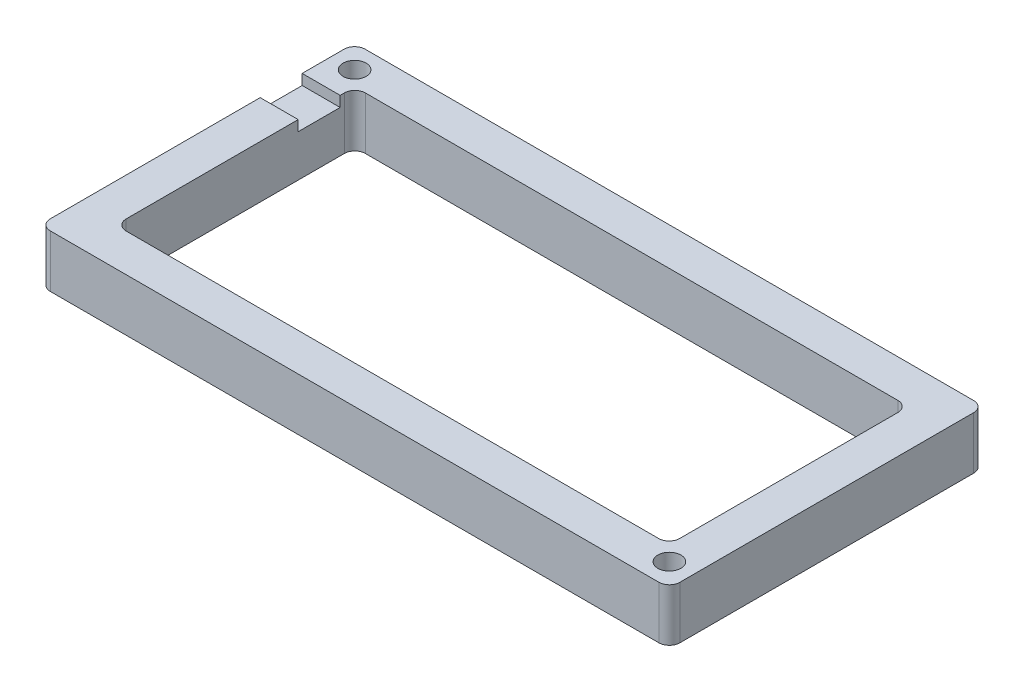
ISO-10303-21;
HEADER;
FILE_DESCRIPTION(('STEP AP214'),'2;1');
FILE_NAME('part.step','',(''),(''),'','','');
FILE_SCHEMA(('AUTOMOTIVE_DESIGN { 1 0 10303 214 1 1 1 1 }'));
ENDSEC;
DATA;
#1=APPLICATION_CONTEXT('core data for automotive mechanical design processes');
#2=APPLICATION_PROTOCOL_DEFINITION('international standard','automotive_design',2000,#1);
#3=PRODUCT_CONTEXT('',#1,'mechanical');
#4=PRODUCT('Part','Part','',(#3));
#5=PRODUCT_RELATED_PRODUCT_CATEGORY('part','',(#4));
#6=PRODUCT_DEFINITION_FORMATION('','',#4);
#7=PRODUCT_DEFINITION_CONTEXT('part definition',#1,'design');
#8=PRODUCT_DEFINITION('design','',#6,#7);
#9=PRODUCT_DEFINITION_SHAPE('','',#8);
#10=(LENGTH_UNIT() NAMED_UNIT(*) SI_UNIT(.MILLI.,.METRE.));
#11=(NAMED_UNIT(*) PLANE_ANGLE_UNIT() SI_UNIT($,.RADIAN.));
#12=(NAMED_UNIT(*) SI_UNIT($,.STERADIAN.) SOLID_ANGLE_UNIT());
#13=UNCERTAINTY_MEASURE_WITH_UNIT(LENGTH_MEASURE(1.E-05),#10,'distance_accuracy_value','');
#14=(GEOMETRIC_REPRESENTATION_CONTEXT(3) GLOBAL_UNCERTAINTY_ASSIGNED_CONTEXT((#13)) GLOBAL_UNIT_ASSIGNED_CONTEXT((#10,
#11,#12)) REPRESENTATION_CONTEXT('',''));
#15=CARTESIAN_POINT('',(0.,0.,0.));
#16=DIRECTION('',(0.,0.,1.));
#17=DIRECTION('',(1.,0.,0.));
#18=AXIS2_PLACEMENT_3D('',#15,#16,#17);
#19=CARTESIAN_POINT('',(0.,12.7,0.));
#20=DIRECTION('',(0.,1.,0.));
#21=DIRECTION('',(0.,0.,1.));
#22=AXIS2_PLACEMENT_3D('',#19,#20,#21);
#23=PLANE('',#22);
#24=CARTESIAN_POINT('',(70.612,12.7,32.512));
#25=DIRECTION('',(0.,1.,0.));
#26=DIRECTION('',(0.,0.,1.));
#27=AXIS2_PLACEMENT_3D('',#24,#25,#26);
#28=CIRCLE('',#27,2.79400000000001);
#29=CARTESIAN_POINT('',(70.612,12.7,35.306));
#30=VERTEX_POINT('',#29);
#31=EDGE_CURVE('E526',#30,#30,#28,.T.);
#32=ORIENTED_EDGE('',*,*,#31,.F.);
#33=EDGE_LOOP('',(#32));
#34=FACE_BOUND('',#33,.T.);
#35=CARTESIAN_POINT('',(-70.612,12.7,-32.512));
#36=DIRECTION('',(0.,1.,0.));
#37=DIRECTION('',(0.,0.,1.));
#38=AXIS2_PLACEMENT_3D('',#35,#36,#37);
#39=CIRCLE('',#38,2.79400000000001);
#40=CARTESIAN_POINT('',(-70.612,12.7,-29.718));
#41=VERTEX_POINT('',#40);
#42=EDGE_CURVE('E198',#41,#41,#39,.T.);
#43=ORIENTED_EDGE('',*,*,#42,.F.);
#44=EDGE_LOOP('',(#43));
#45=FACE_BOUND('',#44,.T.);
#46=DIRECTION('',(-1.,0.,0.));
#47=VECTOR('',#46,1.);
#48=CARTESIAN_POINT('',(-63.5,12.7,-25.4));
#49=LINE('',#48,#47);
#50=CARTESIAN_POINT('',(-66.9974831845845,12.7,-25.4));
#51=VERTEX_POINT('',#50);
#52=CARTESIAN_POINT('',(-76.2,12.7,-25.4));
#53=VERTEX_POINT('',#52);
#54=EDGE_CURVE('E193',#51,#53,#49,.T.);
#55=ORIENTED_EDGE('',*,*,#54,.F.);
#56=DIRECTION('',(0.,0.,1.));
#57=VECTOR('',#56,1.);
#58=CARTESIAN_POINT('',(-66.9974831845845,12.7,-28.956));
#59=LINE('',#58,#57);
#60=CARTESIAN_POINT('',(-66.9974831845845,12.7,-26.416));
#61=VERTEX_POINT('',#60);
#62=EDGE_CURVE('E226',#61,#51,#59,.T.);
#63=ORIENTED_EDGE('',*,*,#62,.F.);
#64=CARTESIAN_POINT('',(-64.4574831845845,12.7,-26.416));
#65=DIRECTION('',(0.,1.,0.));
#66=DIRECTION('',(0.,0.,1.));
#67=AXIS2_PLACEMENT_3D('',#64,#65,#66);
#68=CIRCLE('',#67,2.54);
#69=CARTESIAN_POINT('',(-64.4574831845845,12.7,-28.956));
#70=VERTEX_POINT('',#69);
#71=EDGE_CURVE('E371',#61,#70,#68,.F.);
#72=ORIENTED_EDGE('',*,*,#71,.T.);
#73=DIRECTION('',(-1.,0.,0.));
#74=VECTOR('',#73,1.);
#75=CARTESIAN_POINT('',(-66.9974831845845,12.7,-28.956));
#76=LINE('',#75,#74);
#77=CARTESIAN_POINT('',(64.4574831845845,12.7,-28.956));
#78=VERTEX_POINT('',#77);
#79=EDGE_CURVE('E220',#78,#70,#76,.T.);
#80=ORIENTED_EDGE('',*,*,#79,.F.);
#81=CARTESIAN_POINT('',(64.4574831845845,12.7,-26.416));
#82=DIRECTION('',(0.,1.,0.));
#83=DIRECTION('',(0.,0.,1.));
#84=AXIS2_PLACEMENT_3D('',#81,#82,#83);
#85=CIRCLE('',#84,2.54);
#86=CARTESIAN_POINT('',(66.9974831845845,12.7,-26.416));
#87=VERTEX_POINT('',#86);
#88=EDGE_CURVE('E63',#78,#87,#85,.F.);
#89=ORIENTED_EDGE('',*,*,#88,.T.);
#90=DIRECTION('',(0.,0.,-1.));
#91=VECTOR('',#90,1.);
#92=CARTESIAN_POINT('',(66.9974831845845,12.7,-28.956));
#93=LINE('',#92,#91);
#94=CARTESIAN_POINT('',(66.9974831845845,12.7,26.416));
#95=VERTEX_POINT('',#94);
#96=EDGE_CURVE('E217',#95,#87,#93,.T.);
#97=ORIENTED_EDGE('',*,*,#96,.F.);
#98=CARTESIAN_POINT('',(64.4574831845845,12.7,26.416));
#99=DIRECTION('',(0.,1.,0.));
#100=DIRECTION('',(0.,0.,1.));
#101=AXIS2_PLACEMENT_3D('',#98,#99,#100);
#102=CIRCLE('',#101,2.54);
#103=CARTESIAN_POINT('',(64.4574831845845,12.7,28.956));
#104=VERTEX_POINT('',#103);
#105=EDGE_CURVE('E382',#95,#104,#102,.F.);
#106=ORIENTED_EDGE('',*,*,#105,.T.);
#107=DIRECTION('',(1.,0.,0.));
#108=VECTOR('',#107,1.);
#109=CARTESIAN_POINT('',(-66.9974831845845,12.7,28.956));
#110=LINE('',#109,#108);
#111=CARTESIAN_POINT('',(-64.4574831845845,12.7,28.956));
#112=VERTEX_POINT('',#111);
#113=EDGE_CURVE('E230',#112,#104,#110,.T.);
#114=ORIENTED_EDGE('',*,*,#113,.F.);
#115=CARTESIAN_POINT('',(-64.4574831845845,12.7,26.416));
#116=DIRECTION('',(0.,1.,0.));
#117=DIRECTION('',(0.,0.,1.));
#118=AXIS2_PLACEMENT_3D('',#115,#116,#117);
#119=CIRCLE('',#118,2.54);
#120=CARTESIAN_POINT('',(-66.9974831845845,12.7,26.416));
#121=VERTEX_POINT('',#120);
#122=EDGE_CURVE('E364',#112,#121,#119,.F.);
#123=ORIENTED_EDGE('',*,*,#122,.T.);
#124=CARTESIAN_POINT('',(-66.9974831845845,12.7,-15.24));
#125=VERTEX_POINT('',#124);
#126=EDGE_CURVE('E225',#125,#121,#59,.T.);
#127=ORIENTED_EDGE('',*,*,#126,.F.);
#128=DIRECTION('',(-1.,0.,0.));
#129=VECTOR('',#128,1.);
#130=CARTESIAN_POINT('',(-63.5,12.7,-15.24));
#131=LINE('',#130,#129);
#132=CARTESIAN_POINT('',(-76.2,12.7,-15.24));
#133=VERTEX_POINT('',#132);
#134=EDGE_CURVE('E211',#125,#133,#131,.T.);
#135=ORIENTED_EDGE('',*,*,#134,.T.);
#136=DIRECTION('',(0.,0.,1.));
#137=VECTOR('',#136,1.);
#138=CARTESIAN_POINT('',(-76.2,12.7,-38.1));
#139=LINE('',#138,#137);
#140=CARTESIAN_POINT('',(-76.2,12.7,35.56));
#141=VERTEX_POINT('',#140);
#142=EDGE_CURVE('E258',#133,#141,#139,.T.);
#143=ORIENTED_EDGE('',*,*,#142,.T.);
#144=CARTESIAN_POINT('',(-73.66,12.7,35.56));
#145=DIRECTION('',(0.,1.,0.));
#146=DIRECTION('',(0.,0.,1.));
#147=AXIS2_PLACEMENT_3D('',#144,#145,#146);
#148=CIRCLE('',#147,2.54);
#149=CARTESIAN_POINT('',(-73.66,12.7,38.1));
#150=VERTEX_POINT('',#149);
#151=EDGE_CURVE('E306',#141,#150,#148,.T.);
#152=ORIENTED_EDGE('',*,*,#151,.T.);
#153=DIRECTION('',(1.,0.,0.));
#154=VECTOR('',#153,1.);
#155=CARTESIAN_POINT('',(-76.2,12.7,38.1));
#156=LINE('',#155,#154);
#157=CARTESIAN_POINT('',(73.66,12.7,38.1));
#158=VERTEX_POINT('',#157);
#159=EDGE_CURVE('E262',#150,#158,#156,.T.);
#160=ORIENTED_EDGE('',*,*,#159,.T.);
#161=CARTESIAN_POINT('',(73.66,12.7,35.56));
#162=DIRECTION('',(0.,1.,0.));
#163=DIRECTION('',(0.,0.,1.));
#164=AXIS2_PLACEMENT_3D('',#161,#162,#163);
#165=CIRCLE('',#164,2.54);
#166=CARTESIAN_POINT('',(76.2,12.7,35.56));
#167=VERTEX_POINT('',#166);
#168=EDGE_CURVE('E315',#158,#167,#165,.T.);
#169=ORIENTED_EDGE('',*,*,#168,.T.);
#170=DIRECTION('',(0.,0.,-1.));
#171=VECTOR('',#170,1.);
#172=CARTESIAN_POINT('',(76.2,12.7,-38.1));
#173=LINE('',#172,#171);
#174=CARTESIAN_POINT('',(76.2,12.7,-35.56));
#175=VERTEX_POINT('',#174);
#176=EDGE_CURVE('E249',#167,#175,#173,.T.);
#177=ORIENTED_EDGE('',*,*,#176,.T.);
#178=CARTESIAN_POINT('',(73.66,12.7,-35.56));
#179=DIRECTION('',(0.,1.,0.));
#180=DIRECTION('',(0.,0.,1.));
#181=AXIS2_PLACEMENT_3D('',#178,#179,#180);
#182=CIRCLE('',#181,2.54);
#183=CARTESIAN_POINT('',(73.66,12.7,-38.1));
#184=VERTEX_POINT('',#183);
#185=EDGE_CURVE('E312',#175,#184,#182,.T.);
#186=ORIENTED_EDGE('',*,*,#185,.T.);
#187=DIRECTION('',(-1.,0.,0.));
#188=VECTOR('',#187,1.);
#189=CARTESIAN_POINT('',(-76.2,12.7,-38.1));
#190=LINE('',#189,#188);
#191=CARTESIAN_POINT('',(-73.66,12.7,-38.1));
#192=VERTEX_POINT('',#191);
#193=EDGE_CURVE('E253',#184,#192,#190,.T.);
#194=ORIENTED_EDGE('',*,*,#193,.T.);
#195=CARTESIAN_POINT('',(-73.66,12.7,-35.56));
#196=DIRECTION('',(0.,1.,0.));
#197=DIRECTION('',(0.,0.,1.));
#198=AXIS2_PLACEMENT_3D('',#195,#196,#197);
#199=CIRCLE('',#198,2.54);
#200=CARTESIAN_POINT('',(-76.2,12.7,-35.56));
#201=VERTEX_POINT('',#200);
#202=EDGE_CURVE('E309',#192,#201,#199,.T.);
#203=ORIENTED_EDGE('',*,*,#202,.T.);
#204=EDGE_CURVE('E259',#201,#53,#139,.T.);
#205=ORIENTED_EDGE('',*,*,#204,.T.);
#206=EDGE_LOOP('',(#55,#63,#72,#80,#89,#97,#106,#114,#123,#127,#135,#143,#152,#160,#169,#177,
#186,#194,#203,#205));
#207=FACE_BOUND('',#206,.T.);
#208=ADVANCED_FACE('F39',(#34,#45,#207),#23,.T.);
#209=CARTESIAN_POINT('',(0.,0.,0.));
#210=DIRECTION('',(0.,1.,0.));
#211=DIRECTION('',(0.,0.,1.));
#212=AXIS2_PLACEMENT_3D('',#209,#210,#211);
#213=PLANE('',#212);
#214=CARTESIAN_POINT('',(70.612,0.,32.512));
#215=DIRECTION('',(0.,1.,0.));
#216=DIRECTION('',(0.,0.,1.));
#217=AXIS2_PLACEMENT_3D('',#214,#215,#216);
#218=CIRCLE('',#217,2.79400000000001);
#219=CARTESIAN_POINT('',(70.612,0.,35.306));
#220=VERTEX_POINT('',#219);
#221=EDGE_CURVE('E529',#220,#220,#218,.T.);
#222=ORIENTED_EDGE('',*,*,#221,.T.);
#223=EDGE_LOOP('',(#222));
#224=FACE_BOUND('',#223,.T.);
#225=CARTESIAN_POINT('',(-70.612,0.,-32.512));
#226=DIRECTION('',(0.,1.,0.));
#227=DIRECTION('',(0.,0.,1.));
#228=AXIS2_PLACEMENT_3D('',#225,#226,#227);
#229=CIRCLE('',#228,2.79400000000001);
#230=CARTESIAN_POINT('',(-70.612,0.,-29.718));
#231=VERTEX_POINT('',#230);
#232=EDGE_CURVE('E533',#231,#231,#229,.T.);
#233=ORIENTED_EDGE('',*,*,#232,.T.);
#234=EDGE_LOOP('',(#233));
#235=FACE_BOUND('',#234,.T.);
#236=DIRECTION('',(0.,0.,-1.));
#237=VECTOR('',#236,1.);
#238=CARTESIAN_POINT('',(76.2,0.,-38.1));
#239=LINE('',#238,#237);
#240=CARTESIAN_POINT('',(76.2,0.,35.56));
#241=VERTEX_POINT('',#240);
#242=CARTESIAN_POINT('',(76.2,0.,-35.56));
#243=VERTEX_POINT('',#242);
#244=EDGE_CURVE('E234',#241,#243,#239,.T.);
#245=ORIENTED_EDGE('',*,*,#244,.F.);
#246=CARTESIAN_POINT('',(73.66,0.,35.56));
#247=DIRECTION('',(0.,1.,0.));
#248=DIRECTION('',(0.,0.,1.));
#249=AXIS2_PLACEMENT_3D('',#246,#247,#248);
#250=CIRCLE('',#249,2.54);
#251=CARTESIAN_POINT('',(73.66,0.,38.1));
#252=VERTEX_POINT('',#251);
#253=EDGE_CURVE('E296',#241,#252,#250,.F.);
#254=ORIENTED_EDGE('',*,*,#253,.T.);
#255=DIRECTION('',(1.,0.,0.));
#256=VECTOR('',#255,1.);
#257=CARTESIAN_POINT('',(-76.2,0.,38.1));
#258=LINE('',#257,#256);
#259=CARTESIAN_POINT('',(-73.66,0.,38.1));
#260=VERTEX_POINT('',#259);
#261=EDGE_CURVE('E254',#260,#252,#258,.T.);
#262=ORIENTED_EDGE('',*,*,#261,.F.);
#263=CARTESIAN_POINT('',(-73.66,0.,35.56));
#264=DIRECTION('',(0.,1.,0.));
#265=DIRECTION('',(0.,0.,1.));
#266=AXIS2_PLACEMENT_3D('',#263,#264,#265);
#267=CIRCLE('',#266,2.54);
#268=CARTESIAN_POINT('',(-76.2,0.,35.56));
#269=VERTEX_POINT('',#268);
#270=EDGE_CURVE('E287',#260,#269,#267,.F.);
#271=ORIENTED_EDGE('',*,*,#270,.T.);
#272=DIRECTION('',(0.,0.,1.));
#273=VECTOR('',#272,1.);
#274=CARTESIAN_POINT('',(-76.2,0.,-38.1));
#275=LINE('',#274,#273);
#276=CARTESIAN_POINT('',(-76.2,0.,-35.56));
#277=VERTEX_POINT('',#276);
#278=EDGE_CURVE('E274',#277,#269,#275,.T.);
#279=ORIENTED_EDGE('',*,*,#278,.F.);
#280=CARTESIAN_POINT('',(-73.66,0.,-35.56));
#281=DIRECTION('',(0.,1.,0.));
#282=DIRECTION('',(0.,0.,1.));
#283=AXIS2_PLACEMENT_3D('',#280,#281,#282);
#284=CIRCLE('',#283,2.54);
#285=CARTESIAN_POINT('',(-73.66,0.,-38.1));
#286=VERTEX_POINT('',#285);
#287=EDGE_CURVE('E290',#277,#286,#284,.F.);
#288=ORIENTED_EDGE('',*,*,#287,.T.);
#289=DIRECTION('',(-1.,0.,0.));
#290=VECTOR('',#289,1.);
#291=CARTESIAN_POINT('',(-76.2,0.,-38.1));
#292=LINE('',#291,#290);
#293=CARTESIAN_POINT('',(73.66,0.,-38.1));
#294=VERTEX_POINT('',#293);
#295=EDGE_CURVE('E270',#294,#286,#292,.T.);
#296=ORIENTED_EDGE('',*,*,#295,.F.);
#297=CARTESIAN_POINT('',(73.66,0.,-35.56));
#298=DIRECTION('',(0.,1.,0.));
#299=DIRECTION('',(0.,0.,1.));
#300=AXIS2_PLACEMENT_3D('',#297,#298,#299);
#301=CIRCLE('',#300,2.54);
#302=EDGE_CURVE('E293',#294,#243,#301,.F.);
#303=ORIENTED_EDGE('',*,*,#302,.T.);
#304=EDGE_LOOP('',(#245,#254,#262,#271,#279,#288,#296,#303));
#305=FACE_BOUND('',#304,.T.);
#306=DIRECTION('',(1.,0.,0.));
#307=VECTOR('',#306,1.);
#308=CARTESIAN_POINT('',(-66.9974831845845,0.,28.956));
#309=LINE('',#308,#307);
#310=CARTESIAN_POINT('',(-64.4574831845845,0.,28.956));
#311=VERTEX_POINT('',#310);
#312=CARTESIAN_POINT('',(64.4574831845845,0.,28.956));
#313=VERTEX_POINT('',#312);
#314=EDGE_CURVE('E221',#311,#313,#309,.T.);
#315=ORIENTED_EDGE('',*,*,#314,.T.);
#316=CARTESIAN_POINT('',(64.4574831845845,0.,26.416));
#317=DIRECTION('',(0.,1.,0.));
#318=DIRECTION('',(0.,0.,1.));
#319=AXIS2_PLACEMENT_3D('',#316,#317,#318);
#320=CIRCLE('',#319,2.54);
#321=CARTESIAN_POINT('',(66.9974831845845,0.,26.416));
#322=VERTEX_POINT('',#321);
#323=EDGE_CURVE('E379',#313,#322,#320,.T.);
#324=ORIENTED_EDGE('',*,*,#323,.T.);
#325=DIRECTION('',(0.,0.,-1.));
#326=VECTOR('',#325,1.);
#327=CARTESIAN_POINT('',(66.9974831845845,0.,-28.956));
#328=LINE('',#327,#326);
#329=CARTESIAN_POINT('',(66.9974831845845,0.,-26.416));
#330=VERTEX_POINT('',#329);
#331=EDGE_CURVE('E210',#322,#330,#328,.T.);
#332=ORIENTED_EDGE('',*,*,#331,.T.);
#333=CARTESIAN_POINT('',(64.4574831845845,0.,-26.416));
#334=DIRECTION('',(0.,1.,0.));
#335=DIRECTION('',(0.,0.,1.));
#336=AXIS2_PLACEMENT_3D('',#333,#334,#335);
#337=CIRCLE('',#336,2.54);
#338=CARTESIAN_POINT('',(64.4574831845845,0.,-28.956));
#339=VERTEX_POINT('',#338);
#340=EDGE_CURVE('E374',#330,#339,#337,.T.);
#341=ORIENTED_EDGE('',*,*,#340,.T.);
#342=DIRECTION('',(-1.,0.,0.));
#343=VECTOR('',#342,1.);
#344=CARTESIAN_POINT('',(-66.9974831845845,0.,-28.956));
#345=LINE('',#344,#343);
#346=CARTESIAN_POINT('',(-64.4574831845845,0.,-28.956));
#347=VERTEX_POINT('',#346);
#348=EDGE_CURVE('E238',#339,#347,#345,.T.);
#349=ORIENTED_EDGE('',*,*,#348,.T.);
#350=CARTESIAN_POINT('',(-64.4574831845845,0.,-26.416));
#351=DIRECTION('',(0.,1.,0.));
#352=DIRECTION('',(0.,0.,1.));
#353=AXIS2_PLACEMENT_3D('',#350,#351,#352);
#354=CIRCLE('',#353,2.54);
#355=CARTESIAN_POINT('',(-66.9974831845845,0.,-26.416));
#356=VERTEX_POINT('',#355);
#357=EDGE_CURVE('E368',#347,#356,#354,.T.);
#358=ORIENTED_EDGE('',*,*,#357,.T.);
#359=DIRECTION('',(0.,0.,1.));
#360=VECTOR('',#359,1.);
#361=CARTESIAN_POINT('',(-66.9974831845845,0.,-28.956));
#362=LINE('',#361,#360);
#363=CARTESIAN_POINT('',(-66.9974831845845,0.,26.416));
#364=VERTEX_POINT('',#363);
#365=EDGE_CURVE('E242',#356,#364,#362,.T.);
#366=ORIENTED_EDGE('',*,*,#365,.T.);
#367=CARTESIAN_POINT('',(-64.4574831845845,0.,26.416));
#368=DIRECTION('',(0.,1.,0.));
#369=DIRECTION('',(0.,0.,1.));
#370=AXIS2_PLACEMENT_3D('',#367,#368,#369);
#371=CIRCLE('',#370,2.54);
#372=EDGE_CURVE('E361',#364,#311,#371,.T.);
#373=ORIENTED_EDGE('',*,*,#372,.T.);
#374=EDGE_LOOP('',(#315,#324,#332,#341,#349,#358,#366,#373));
#375=FACE_BOUND('',#374,.T.);
#376=ADVANCED_FACE('F404',(#224,#235,#305,#375),#213,.F.);
#377=CARTESIAN_POINT('',(76.2,12.7,-38.1));
#378=DIRECTION('',(-1.,0.,0.));
#379=DIRECTION('',(0.,0.,1.));
#380=AXIS2_PLACEMENT_3D('',#377,#378,#379);
#381=PLANE('',#380);
#382=ORIENTED_EDGE('',*,*,#176,.F.);
#383=DIRECTION('',(0.,-1.,0.));
#384=VECTOR('',#383,1.);
#385=CARTESIAN_POINT('',(76.2,12.7,35.56));
#386=LINE('',#385,#384);
#387=EDGE_CURVE('E283',#167,#241,#386,.T.);
#388=ORIENTED_EDGE('',*,*,#387,.T.);
#389=ORIENTED_EDGE('',*,*,#244,.T.);
#390=DIRECTION('',(0.,-1.,0.));
#391=VECTOR('',#390,1.);
#392=CARTESIAN_POINT('',(76.2,12.7,-35.56));
#393=LINE('',#392,#391);
#394=EDGE_CURVE('E266',#243,#175,#393,.F.);
#395=ORIENTED_EDGE('',*,*,#394,.T.);
#396=EDGE_LOOP('',(#382,#388,#389,#395));
#397=FACE_BOUND('',#396,.T.);
#398=ADVANCED_FACE('F416',(#397),#381,.F.);
#399=CARTESIAN_POINT('',(-76.2,12.7,-38.1));
#400=DIRECTION('',(0.,0.,1.));
#401=DIRECTION('',(1.,0.,0.));
#402=AXIS2_PLACEMENT_3D('',#399,#400,#401);
#403=PLANE('',#402);
#404=ORIENTED_EDGE('',*,*,#193,.F.);
#405=DIRECTION('',(0.,-1.,0.));
#406=VECTOR('',#405,1.);
#407=CARTESIAN_POINT('',(73.66,12.7,-38.1));
#408=LINE('',#407,#406);
#409=EDGE_CURVE('E321',#184,#294,#408,.T.);
#410=ORIENTED_EDGE('',*,*,#409,.T.);
#411=ORIENTED_EDGE('',*,*,#295,.T.);
#412=DIRECTION('',(0.,-1.,0.));
#413=VECTOR('',#412,1.);
#414=CARTESIAN_POINT('',(-73.66,12.7,-38.1));
#415=LINE('',#414,#413);
#416=EDGE_CURVE('E318',#286,#192,#415,.F.);
#417=ORIENTED_EDGE('',*,*,#416,.T.);
#418=EDGE_LOOP('',(#404,#410,#411,#417));
#419=FACE_BOUND('',#418,.T.);
#420=ADVANCED_FACE('F408',(#419),#403,.F.);
#421=CARTESIAN_POINT('',(-76.2,12.7,-38.1));
#422=DIRECTION('',(1.,0.,0.));
#423=DIRECTION('',(0.,0.,-1.));
#424=AXIS2_PLACEMENT_3D('',#421,#422,#423);
#425=PLANE('',#424);
#426=DIRECTION('',(0.,0.,1.));
#427=VECTOR('',#426,1.);
#428=CARTESIAN_POINT('',(-76.2,10.16,-25.4));
#429=LINE('',#428,#427);
#430=CARTESIAN_POINT('',(-76.2,10.16,-25.4));
#431=VERTEX_POINT('',#430);
#432=CARTESIAN_POINT('',(-76.2,10.16,-15.24));
#433=VERTEX_POINT('',#432);
#434=EDGE_CURVE('E180',#431,#433,#429,.T.);
#435=ORIENTED_EDGE('',*,*,#434,.F.);
#436=DIRECTION('',(0.,-1.,0.));
#437=VECTOR('',#436,1.);
#438=CARTESIAN_POINT('',(-76.2,12.7,-25.4));
#439=LINE('',#438,#437);
#440=EDGE_CURVE('E190',#53,#431,#439,.T.);
#441=ORIENTED_EDGE('',*,*,#440,.F.);
#442=ORIENTED_EDGE('',*,*,#204,.F.);
#443=DIRECTION('',(0.,-1.,0.));
#444=VECTOR('',#443,1.);
#445=CARTESIAN_POINT('',(-76.2,12.7,-35.56));
#446=LINE('',#445,#444);
#447=EDGE_CURVE('E329',#201,#277,#446,.T.);
#448=ORIENTED_EDGE('',*,*,#447,.T.);
#449=ORIENTED_EDGE('',*,*,#278,.T.);
#450=DIRECTION('',(0.,-1.,0.));
#451=VECTOR('',#450,1.);
#452=CARTESIAN_POINT('',(-76.2,12.7,35.56));
#453=LINE('',#452,#451);
#454=EDGE_CURVE('E325',#269,#141,#453,.F.);
#455=ORIENTED_EDGE('',*,*,#454,.T.);
#456=ORIENTED_EDGE('',*,*,#142,.F.);
#457=DIRECTION('',(0.,1.,0.));
#458=VECTOR('',#457,1.);
#459=CARTESIAN_POINT('',(-76.2,12.7,-15.24));
#460=LINE('',#459,#458);
#461=EDGE_CURVE('E187',#433,#133,#460,.T.);
#462=ORIENTED_EDGE('',*,*,#461,.F.);
#463=EDGE_LOOP('',(#435,#441,#442,#448,#449,#455,#456,#462));
#464=FACE_BOUND('',#463,.T.);
#465=ADVANCED_FACE('F200',(#464),#425,.F.);
#466=CARTESIAN_POINT('',(-76.2,12.7,38.1));
#467=DIRECTION('',(0.,0.,-1.));
#468=DIRECTION('',(-1.,0.,0.));
#469=AXIS2_PLACEMENT_3D('',#466,#467,#468);
#470=PLANE('',#469);
#471=ORIENTED_EDGE('',*,*,#261,.T.);
#472=DIRECTION('',(0.,-1.,0.));
#473=VECTOR('',#472,1.);
#474=CARTESIAN_POINT('',(73.66,12.7,38.1));
#475=LINE('',#474,#473);
#476=EDGE_CURVE('E303',#252,#158,#475,.F.);
#477=ORIENTED_EDGE('',*,*,#476,.T.);
#478=ORIENTED_EDGE('',*,*,#159,.F.);
#479=DIRECTION('',(0.,-1.,0.));
#480=VECTOR('',#479,1.);
#481=CARTESIAN_POINT('',(-73.66,12.7,38.1));
#482=LINE('',#481,#480);
#483=EDGE_CURVE('E299',#150,#260,#482,.T.);
#484=ORIENTED_EDGE('',*,*,#483,.T.);
#485=EDGE_LOOP('',(#471,#477,#478,#484));
#486=FACE_BOUND('',#485,.T.);
#487=ADVANCED_FACE('F424',(#486),#470,.F.);
#488=CARTESIAN_POINT('',(73.66,12.7,35.56));
#489=DIRECTION('',(0.,-1.,0.));
#490=DIRECTION('',(0.,0.,-1.));
#491=AXIS2_PLACEMENT_3D('',#488,#489,#490);
#492=CYLINDRICAL_SURFACE('',#491,2.54);
#493=ORIENTED_EDGE('',*,*,#168,.F.);
#494=ORIENTED_EDGE('',*,*,#476,.F.);
#495=ORIENTED_EDGE('',*,*,#253,.F.);
#496=ORIENTED_EDGE('',*,*,#387,.F.);
#497=EDGE_LOOP('',(#493,#494,#495,#496));
#498=FACE_BOUND('',#497,.T.);
#499=ADVANCED_FACE('F420',(#498),#492,.T.);
#500=CARTESIAN_POINT('',(73.66,12.7,-35.56));
#501=DIRECTION('',(0.,-1.,0.));
#502=DIRECTION('',(0.,0.,-1.));
#503=AXIS2_PLACEMENT_3D('',#500,#501,#502);
#504=CYLINDRICAL_SURFACE('',#503,2.54);
#505=ORIENTED_EDGE('',*,*,#185,.F.);
#506=ORIENTED_EDGE('',*,*,#394,.F.);
#507=ORIENTED_EDGE('',*,*,#302,.F.);
#508=ORIENTED_EDGE('',*,*,#409,.F.);
#509=EDGE_LOOP('',(#505,#506,#507,#508));
#510=FACE_BOUND('',#509,.T.);
#511=ADVANCED_FACE('F412',(#510),#504,.T.);
#512=CARTESIAN_POINT('',(-73.66,12.7,-35.56));
#513=DIRECTION('',(0.,-1.,0.));
#514=DIRECTION('',(0.,0.,-1.));
#515=AXIS2_PLACEMENT_3D('',#512,#513,#514);
#516=CYLINDRICAL_SURFACE('',#515,2.54);
#517=ORIENTED_EDGE('',*,*,#202,.F.);
#518=ORIENTED_EDGE('',*,*,#416,.F.);
#519=ORIENTED_EDGE('',*,*,#287,.F.);
#520=ORIENTED_EDGE('',*,*,#447,.F.);
#521=EDGE_LOOP('',(#517,#518,#519,#520));
#522=FACE_BOUND('',#521,.T.);
#523=ADVANCED_FACE('F399',(#522),#516,.T.);
#524=CARTESIAN_POINT('',(-73.66,12.7,35.56));
#525=DIRECTION('',(0.,-1.,0.));
#526=DIRECTION('',(0.,0.,-1.));
#527=AXIS2_PLACEMENT_3D('',#524,#525,#526);
#528=CYLINDRICAL_SURFACE('',#527,2.54);
#529=ORIENTED_EDGE('',*,*,#151,.F.);
#530=ORIENTED_EDGE('',*,*,#454,.F.);
#531=ORIENTED_EDGE('',*,*,#270,.F.);
#532=ORIENTED_EDGE('',*,*,#483,.F.);
#533=EDGE_LOOP('',(#529,#530,#531,#532));
#534=FACE_BOUND('',#533,.T.);
#535=ADVANCED_FACE('F429',(#534),#528,.T.);
#536=CARTESIAN_POINT('',(66.9974831845845,12.7,-28.956));
#537=DIRECTION('',(-1.,0.,0.));
#538=DIRECTION('',(0.,0.,1.));
#539=AXIS2_PLACEMENT_3D('',#536,#537,#538);
#540=PLANE('',#539);
#541=ORIENTED_EDGE('',*,*,#96,.T.);
#542=DIRECTION('',(0.,-1.,0.));
#543=VECTOR('',#542,1.);
#544=CARTESIAN_POINT('',(66.9974831845845,0.,-26.416));
#545=LINE('',#544,#543);
#546=EDGE_CURVE('E357',#87,#330,#545,.T.);
#547=ORIENTED_EDGE('',*,*,#546,.T.);
#548=ORIENTED_EDGE('',*,*,#331,.F.);
#549=DIRECTION('',(0.,-1.,0.));
#550=VECTOR('',#549,1.);
#551=CARTESIAN_POINT('',(66.9974831845845,12.7,26.416));
#552=LINE('',#551,#550);
#553=EDGE_CURVE('E354',#322,#95,#552,.F.);
#554=ORIENTED_EDGE('',*,*,#553,.T.);
#555=EDGE_LOOP('',(#541,#547,#548,#554));
#556=FACE_BOUND('',#555,.T.);
#557=ADVANCED_FACE('F449',(#556),#540,.T.);
#558=CARTESIAN_POINT('',(-66.9974831845845,12.7,-28.956));
#559=DIRECTION('',(0.,0.,1.));
#560=DIRECTION('',(1.,0.,0.));
#561=AXIS2_PLACEMENT_3D('',#558,#559,#560);
#562=PLANE('',#561);
#563=ORIENTED_EDGE('',*,*,#79,.T.);
#564=DIRECTION('',(0.,-1.,0.));
#565=VECTOR('',#564,1.);
#566=CARTESIAN_POINT('',(-64.4574831845845,0.,-28.956));
#567=LINE('',#566,#565);
#568=EDGE_CURVE('E350',#70,#347,#567,.T.);
#569=ORIENTED_EDGE('',*,*,#568,.T.);
#570=ORIENTED_EDGE('',*,*,#348,.F.);
#571=DIRECTION('',(0.,-1.,0.));
#572=VECTOR('',#571,1.);
#573=CARTESIAN_POINT('',(64.4574831845845,12.7,-28.956));
#574=LINE('',#573,#572);
#575=EDGE_CURVE('E347',#339,#78,#574,.F.);
#576=ORIENTED_EDGE('',*,*,#575,.T.);
#577=EDGE_LOOP('',(#563,#569,#570,#576));
#578=FACE_BOUND('',#577,.T.);
#579=ADVANCED_FACE('F456',(#578),#562,.T.);
#580=CARTESIAN_POINT('',(-66.9974831845845,12.7,-28.956));
#581=DIRECTION('',(1.,0.,0.));
#582=DIRECTION('',(0.,0.,-1.));
#583=AXIS2_PLACEMENT_3D('',#580,#581,#582);
#584=PLANE('',#583);
#585=DIRECTION('',(0.,1.,0.));
#586=VECTOR('',#585,1.);
#587=CARTESIAN_POINT('',(-66.9974831845845,12.7,-25.4));
#588=LINE('',#587,#586);
#589=CARTESIAN_POINT('',(-66.9974831845845,10.16,-25.4));
#590=VERTEX_POINT('',#589);
#591=EDGE_CURVE('E11',#590,#51,#588,.T.);
#592=ORIENTED_EDGE('',*,*,#591,.F.);
#593=DIRECTION('',(0.,0.,-1.));
#594=VECTOR('',#593,1.);
#595=CARTESIAN_POINT('',(-66.9974831845845,10.16,-28.956));
#596=LINE('',#595,#594);
#597=CARTESIAN_POINT('',(-66.9974831845845,10.16,-15.24));
#598=VERTEX_POINT('',#597);
#599=EDGE_CURVE('E183',#598,#590,#596,.T.);
#600=ORIENTED_EDGE('',*,*,#599,.F.);
#601=DIRECTION('',(0.,-1.,0.));
#602=VECTOR('',#601,1.);
#603=CARTESIAN_POINT('',(-66.9974831845845,12.7,-15.24));
#604=LINE('',#603,#602);
#605=EDGE_CURVE('E48',#125,#598,#604,.T.);
#606=ORIENTED_EDGE('',*,*,#605,.F.);
#607=ORIENTED_EDGE('',*,*,#126,.T.);
#608=DIRECTION('',(0.,-1.,0.));
#609=VECTOR('',#608,1.);
#610=CARTESIAN_POINT('',(-66.9974831845845,0.,26.416));
#611=LINE('',#610,#609);
#612=EDGE_CURVE('E336',#121,#364,#611,.T.);
#613=ORIENTED_EDGE('',*,*,#612,.T.);
#614=ORIENTED_EDGE('',*,*,#365,.F.);
#615=DIRECTION('',(0.,-1.,0.));
#616=VECTOR('',#615,1.);
#617=CARTESIAN_POINT('',(-66.9974831845845,12.7,-26.416));
#618=LINE('',#617,#616);
#619=EDGE_CURVE('E333',#356,#61,#618,.F.);
#620=ORIENTED_EDGE('',*,*,#619,.T.);
#621=ORIENTED_EDGE('',*,*,#62,.T.);
#622=EDGE_LOOP('',(#592,#600,#606,#607,#613,#614,#620,#621));
#623=FACE_BOUND('',#622,.T.);
#624=ADVANCED_FACE('F392',(#623),#584,.T.);
#625=CARTESIAN_POINT('',(-66.9974831845845,12.7,28.956));
#626=DIRECTION('',(0.,0.,-1.));
#627=DIRECTION('',(-1.,0.,0.));
#628=AXIS2_PLACEMENT_3D('',#625,#626,#627);
#629=PLANE('',#628);
#630=ORIENTED_EDGE('',*,*,#314,.F.);
#631=DIRECTION('',(0.,-1.,0.));
#632=VECTOR('',#631,1.);
#633=CARTESIAN_POINT('',(-64.4574831845845,12.7,28.956));
#634=LINE('',#633,#632);
#635=EDGE_CURVE('E344',#311,#112,#634,.F.);
#636=ORIENTED_EDGE('',*,*,#635,.T.);
#637=ORIENTED_EDGE('',*,*,#113,.T.);
#638=DIRECTION('',(0.,-1.,0.));
#639=VECTOR('',#638,1.);
#640=CARTESIAN_POINT('',(64.4574831845845,0.,28.956));
#641=LINE('',#640,#639);
#642=EDGE_CURVE('E340',#104,#313,#641,.T.);
#643=ORIENTED_EDGE('',*,*,#642,.T.);
#644=EDGE_LOOP('',(#630,#636,#637,#643));
#645=FACE_BOUND('',#644,.T.);
#646=ADVANCED_FACE('F442',(#645),#629,.T.);
#647=CARTESIAN_POINT('',(-64.4574831845845,12.7,26.416));
#648=DIRECTION('',(0.,1.,0.));
#649=DIRECTION('',(0.,0.,1.));
#650=AXIS2_PLACEMENT_3D('',#647,#648,#649);
#651=CYLINDRICAL_SURFACE('',#650,2.54);
#652=ORIENTED_EDGE('',*,*,#122,.F.);
#653=ORIENTED_EDGE('',*,*,#635,.F.);
#654=ORIENTED_EDGE('',*,*,#372,.F.);
#655=ORIENTED_EDGE('',*,*,#612,.F.);
#656=EDGE_LOOP('',(#652,#653,#654,#655));
#657=FACE_BOUND('',#656,.T.);
#658=ADVANCED_FACE('F439',(#657),#651,.F.);
#659=CARTESIAN_POINT('',(-64.4574831845845,12.7,-26.416));
#660=DIRECTION('',(0.,1.,0.));
#661=DIRECTION('',(0.,0.,1.));
#662=AXIS2_PLACEMENT_3D('',#659,#660,#661);
#663=CYLINDRICAL_SURFACE('',#662,2.54);
#664=ORIENTED_EDGE('',*,*,#71,.F.);
#665=ORIENTED_EDGE('',*,*,#619,.F.);
#666=ORIENTED_EDGE('',*,*,#357,.F.);
#667=ORIENTED_EDGE('',*,*,#568,.F.);
#668=EDGE_LOOP('',(#664,#665,#666,#667));
#669=FACE_BOUND('',#668,.T.);
#670=ADVANCED_FACE('F459',(#669),#663,.F.);
#671=CARTESIAN_POINT('',(64.4574831845845,12.7,-26.416));
#672=DIRECTION('',(0.,1.,0.));
#673=DIRECTION('',(0.,0.,1.));
#674=AXIS2_PLACEMENT_3D('',#671,#672,#673);
#675=CYLINDRICAL_SURFACE('',#674,2.54);
#676=ORIENTED_EDGE('',*,*,#88,.F.);
#677=ORIENTED_EDGE('',*,*,#575,.F.);
#678=ORIENTED_EDGE('',*,*,#340,.F.);
#679=ORIENTED_EDGE('',*,*,#546,.F.);
#680=EDGE_LOOP('',(#676,#677,#678,#679));
#681=FACE_BOUND('',#680,.T.);
#682=ADVANCED_FACE('F452',(#681),#675,.F.);
#683=CARTESIAN_POINT('',(64.4574831845845,12.7,26.416));
#684=DIRECTION('',(0.,1.,0.));
#685=DIRECTION('',(0.,0.,1.));
#686=AXIS2_PLACEMENT_3D('',#683,#684,#685);
#687=CYLINDRICAL_SURFACE('',#686,2.54);
#688=ORIENTED_EDGE('',*,*,#105,.F.);
#689=ORIENTED_EDGE('',*,*,#553,.F.);
#690=ORIENTED_EDGE('',*,*,#323,.F.);
#691=ORIENTED_EDGE('',*,*,#642,.F.);
#692=EDGE_LOOP('',(#688,#689,#690,#691));
#693=FACE_BOUND('',#692,.T.);
#694=ADVANCED_FACE('F41',(#693),#687,.F.);
#695=CARTESIAN_POINT('',(-63.5,12.7,-25.4));
#696=DIRECTION('',(0.,0.,-1.));
#697=DIRECTION('',(-1.,0.,0.));
#698=AXIS2_PLACEMENT_3D('',#695,#696,#697);
#699=PLANE('',#698);
#700=ORIENTED_EDGE('',*,*,#591,.T.);
#701=ORIENTED_EDGE('',*,*,#54,.T.);
#702=ORIENTED_EDGE('',*,*,#440,.T.);
#703=DIRECTION('',(-1.,0.,0.));
#704=VECTOR('',#703,1.);
#705=CARTESIAN_POINT('',(-63.5,10.16,-25.4));
#706=LINE('',#705,#704);
#707=EDGE_CURVE('E176',#590,#431,#706,.T.);
#708=ORIENTED_EDGE('',*,*,#707,.F.);
#709=EDGE_LOOP('',(#700,#701,#702,#708));
#710=FACE_BOUND('',#709,.T.);
#711=ADVANCED_FACE('F191',(#710),#699,.F.);
#712=CARTESIAN_POINT('',(-63.5,12.7,-15.24));
#713=DIRECTION('',(0.,0.,1.));
#714=DIRECTION('',(1.,0.,0.));
#715=AXIS2_PLACEMENT_3D('',#712,#713,#714);
#716=PLANE('',#715);
#717=ORIENTED_EDGE('',*,*,#605,.T.);
#718=DIRECTION('',(-1.,0.,0.));
#719=VECTOR('',#718,1.);
#720=CARTESIAN_POINT('',(-63.5,10.16,-15.24));
#721=LINE('',#720,#719);
#722=EDGE_CURVE('E55',#598,#433,#721,.T.);
#723=ORIENTED_EDGE('',*,*,#722,.T.);
#724=ORIENTED_EDGE('',*,*,#461,.T.);
#725=ORIENTED_EDGE('',*,*,#134,.F.);
#726=EDGE_LOOP('',(#717,#723,#724,#725));
#727=FACE_BOUND('',#726,.T.);
#728=ADVANCED_FACE('F389',(#727),#716,.F.);
#729=CARTESIAN_POINT('',(-63.5,10.16,-25.4));
#730=DIRECTION('',(0.,-1.,0.));
#731=DIRECTION('',(0.,0.,-1.));
#732=AXIS2_PLACEMENT_3D('',#729,#730,#731);
#733=PLANE('',#732);
#734=ORIENTED_EDGE('',*,*,#599,.T.);
#735=ORIENTED_EDGE('',*,*,#707,.T.);
#736=ORIENTED_EDGE('',*,*,#434,.T.);
#737=ORIENTED_EDGE('',*,*,#722,.F.);
#738=EDGE_LOOP('',(#734,#735,#736,#737));
#739=FACE_BOUND('',#738,.T.);
#740=ADVANCED_FACE('F178',(#739),#733,.F.);
#741=CARTESIAN_POINT('',(-70.612,12.7,-32.512));
#742=DIRECTION('',(0.,-1.,0.));
#743=DIRECTION('',(0.,0.,-1.));
#744=AXIS2_PLACEMENT_3D('',#741,#742,#743);
#745=CYLINDRICAL_SURFACE('',#744,2.79400000000001);
#746=ORIENTED_EDGE('',*,*,#42,.T.);
#747=EDGE_LOOP('',(#746));
#748=FACE_BOUND('',#747,.T.);
#749=ORIENTED_EDGE('',*,*,#232,.F.);
#750=EDGE_LOOP('',(#749));
#751=FACE_BOUND('',#750,.T.);
#752=ADVANCED_FACE('F513',(#748,#751),#745,.F.);
#753=CARTESIAN_POINT('',(70.612,12.7,32.512));
#754=DIRECTION('',(0.,-1.,0.));
#755=DIRECTION('',(0.,0.,-1.));
#756=AXIS2_PLACEMENT_3D('',#753,#754,#755);
#757=CYLINDRICAL_SURFACE('',#756,2.79400000000001);
#758=ORIENTED_EDGE('',*,*,#31,.T.);
#759=EDGE_LOOP('',(#758));
#760=FACE_BOUND('',#759,.T.);
#761=ORIENTED_EDGE('',*,*,#221,.F.);
#762=EDGE_LOOP('',(#761));
#763=FACE_BOUND('',#762,.T.);
#764=ADVANCED_FACE('F518',(#760,#763),#757,.F.);
#765=CLOSED_SHELL('',(#208,#376,#398,#420,#465,#487,#499,#511,#523,#535,#557,#579,#624,#646,
#658,#670,#682,#694,#711,#728,#740,#752,#764));
#766=MANIFOLD_SOLID_BREP('B2',#765);
#767=ADVANCED_BREP_SHAPE_REPRESENTATION('',(#18,#766),#14);
#768=SHAPE_DEFINITION_REPRESENTATION(#9,#767);
ENDSEC;
END-ISO-10303-21;
